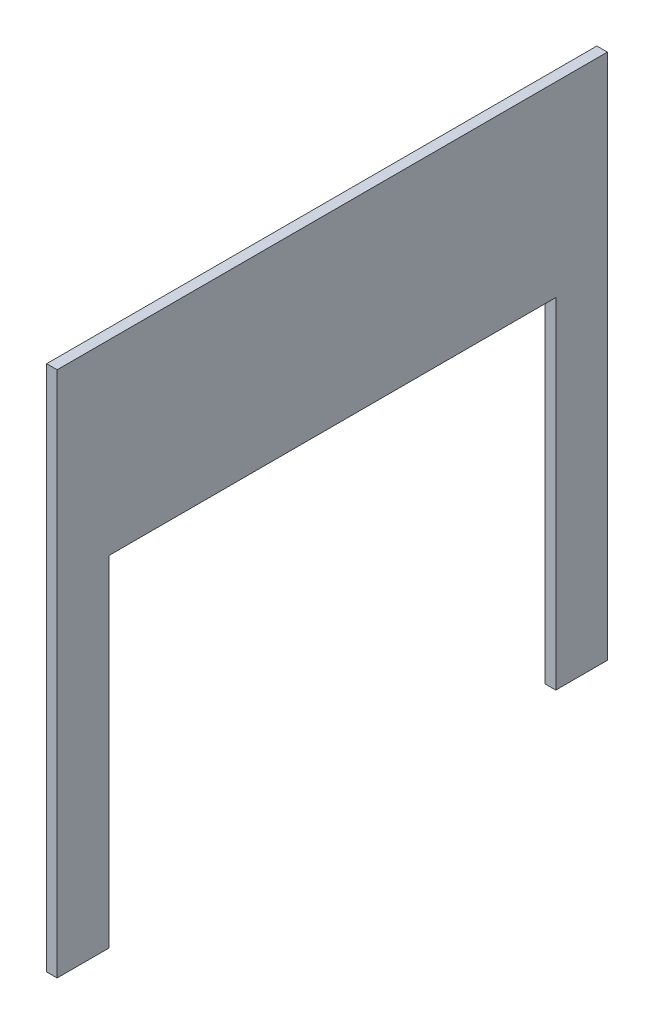
ISO-10303-21;
HEADER;
FILE_DESCRIPTION(('STEP AP214'),'2;1');
FILE_NAME('part.step','',(''),(''),'','','');
FILE_SCHEMA(('AUTOMOTIVE_DESIGN { 1 0 10303 214 1 1 1 1 }'));
ENDSEC;
DATA;
#1=APPLICATION_CONTEXT('core data for automotive mechanical design processes');
#2=APPLICATION_PROTOCOL_DEFINITION('international standard','automotive_design',2000,#1);
#3=PRODUCT_CONTEXT('',#1,'mechanical');
#4=PRODUCT('Part','Part','',(#3));
#5=PRODUCT_RELATED_PRODUCT_CATEGORY('part','',(#4));
#6=PRODUCT_DEFINITION_FORMATION('','',#4);
#7=PRODUCT_DEFINITION_CONTEXT('part definition',#1,'design');
#8=PRODUCT_DEFINITION('design','',#6,#7);
#9=PRODUCT_DEFINITION_SHAPE('','',#8);
#10=(LENGTH_UNIT() NAMED_UNIT(*) SI_UNIT(.MILLI.,.METRE.));
#11=(NAMED_UNIT(*) PLANE_ANGLE_UNIT() SI_UNIT($,.RADIAN.));
#12=(NAMED_UNIT(*) SI_UNIT($,.STERADIAN.) SOLID_ANGLE_UNIT());
#13=UNCERTAINTY_MEASURE_WITH_UNIT(LENGTH_MEASURE(1.E-05),#10,'distance_accuracy_value','');
#14=(GEOMETRIC_REPRESENTATION_CONTEXT(3) GLOBAL_UNCERTAINTY_ASSIGNED_CONTEXT((#13)) GLOBAL_UNIT_ASSIGNED_CONTEXT((#10,
#11,#12)) REPRESENTATION_CONTEXT('',''));
#15=CARTESIAN_POINT('',(0.,0.,0.));
#16=DIRECTION('',(0.,0.,1.));
#17=DIRECTION('',(1.,0.,0.));
#18=AXIS2_PLACEMENT_3D('',#15,#16,#17);
#19=CARTESIAN_POINT('',(10.,0.,0.));
#20=DIRECTION('',(0.,1.,0.));
#21=DIRECTION('',(0.,0.,1.));
#22=AXIS2_PLACEMENT_3D('',#19,#20,#21);
#23=PLANE('',#22);
#24=DIRECTION('',(0.,0.,-1.));
#25=VECTOR('',#24,1.);
#26=CARTESIAN_POINT('',(10.,0.,0.));
#27=LINE('',#26,#25);
#28=CARTESIAN_POINT('',(10.,0.,-473.3));
#29=VERTEX_POINT('',#28);
#30=CARTESIAN_POINT('',(10.,0.,-522.3));
#31=VERTEX_POINT('',#30);
#32=EDGE_CURVE('E123',#29,#31,#27,.T.);
#33=ORIENTED_EDGE('',*,*,#32,.F.);
#34=DIRECTION('',(-1.,0.,0.));
#35=VECTOR('',#34,1.);
#36=CARTESIAN_POINT('',(10.,0.,-473.3));
#37=LINE('',#36,#35);
#38=CARTESIAN_POINT('',(0.,0.,-473.3));
#39=VERTEX_POINT('',#38);
#40=EDGE_CURVE('E110',#29,#39,#37,.T.);
#41=ORIENTED_EDGE('',*,*,#40,.T.);
#42=DIRECTION('',(0.,0.,-1.));
#43=VECTOR('',#42,1.);
#44=CARTESIAN_POINT('',(0.,0.,0.));
#45=LINE('',#44,#43);
#46=CARTESIAN_POINT('',(0.,0.,-522.3));
#47=VERTEX_POINT('',#46);
#48=EDGE_CURVE('E143',#39,#47,#45,.T.);
#49=ORIENTED_EDGE('',*,*,#48,.T.);
#50=DIRECTION('',(-1.,0.,0.));
#51=VECTOR('',#50,1.);
#52=CARTESIAN_POINT('',(10.,0.,-522.3));
#53=LINE('',#52,#51);
#54=EDGE_CURVE('E43',#31,#47,#53,.T.);
#55=ORIENTED_EDGE('',*,*,#54,.F.);
#56=EDGE_LOOP('',(#33,#41,#49,#55));
#57=FACE_BOUND('',#56,.T.);
#58=ADVANCED_FACE('F35',(#57),#23,.F.);
#59=CARTESIAN_POINT('',(10.,0.,0.));
#60=DIRECTION('',(0.,0.,-1.));
#61=DIRECTION('',(0.,1.,0.));
#62=AXIS2_PLACEMENT_3D('',#59,#60,#61);
#63=PLANE('',#62);
#64=DIRECTION('',(0.,-1.,0.));
#65=VECTOR('',#64,1.);
#66=CARTESIAN_POINT('',(0.,0.,0.));
#67=LINE('',#66,#65);
#68=CARTESIAN_POINT('',(0.,500.,-1.11022302462516E-13));
#69=VERTEX_POINT('',#68);
#70=CARTESIAN_POINT('',(0.,0.,0.));
#71=VERTEX_POINT('',#70);
#72=EDGE_CURVE('E140',#69,#71,#67,.T.);
#73=ORIENTED_EDGE('',*,*,#72,.T.);
#74=DIRECTION('',(-1.,0.,0.));
#75=VECTOR('',#74,1.);
#76=CARTESIAN_POINT('',(10.,0.,0.));
#77=LINE('',#76,#75);
#78=CARTESIAN_POINT('',(10.,0.,0.));
#79=VERTEX_POINT('',#78);
#80=EDGE_CURVE('E11',#79,#71,#77,.T.);
#81=ORIENTED_EDGE('',*,*,#80,.F.);
#82=DIRECTION('',(0.,-1.,0.));
#83=VECTOR('',#82,1.);
#84=CARTESIAN_POINT('',(10.,0.,0.));
#85=LINE('',#84,#83);
#86=CARTESIAN_POINT('',(10.,500.,-1.11022302462516E-13));
#87=VERTEX_POINT('',#86);
#88=EDGE_CURVE('E132',#87,#79,#85,.T.);
#89=ORIENTED_EDGE('',*,*,#88,.F.);
#90=DIRECTION('',(-1.,0.,0.));
#91=VECTOR('',#90,1.);
#92=CARTESIAN_POINT('',(10.,500.,-1.11022302462516E-13));
#93=LINE('',#92,#91);
#94=EDGE_CURVE('E139',#87,#69,#93,.T.);
#95=ORIENTED_EDGE('',*,*,#94,.T.);
#96=EDGE_LOOP('',(#73,#81,#89,#95));
#97=FACE_BOUND('',#96,.T.);
#98=ADVANCED_FACE('F37',(#97),#63,.F.);
#99=CARTESIAN_POINT('',(0.,0.,-49.0000000000001));
#100=VERTEX_POINT('',#99);
#101=EDGE_CURVE('E145',#71,#100,#45,.T.);
#102=ORIENTED_EDGE('',*,*,#101,.T.);
#103=DIRECTION('',(-1.,0.,0.));
#104=VECTOR('',#103,1.);
#105=CARTESIAN_POINT('',(10.,0.,-49.0000000000001));
#106=LINE('',#105,#104);
#107=CARTESIAN_POINT('',(10.,0.,-49.0000000000001));
#108=VERTEX_POINT('',#107);
#109=EDGE_CURVE('E50',#108,#100,#106,.T.);
#110=ORIENTED_EDGE('',*,*,#109,.F.);
#111=EDGE_CURVE('E86',#79,#108,#27,.T.);
#112=ORIENTED_EDGE('',*,*,#111,.F.);
#113=ORIENTED_EDGE('',*,*,#80,.T.);
#114=EDGE_LOOP('',(#102,#110,#112,#113));
#115=FACE_BOUND('',#114,.T.);
#116=ADVANCED_FACE('F171',(#115),#23,.F.);
#117=CARTESIAN_POINT('',(10.,0.,-522.3));
#118=DIRECTION('',(0.,0.,1.));
#119=DIRECTION('',(1.,0.,0.));
#120=AXIS2_PLACEMENT_3D('',#117,#118,#119);
#121=PLANE('',#120);
#122=DIRECTION('',(0.,1.,0.));
#123=VECTOR('',#122,1.);
#124=CARTESIAN_POINT('',(0.,0.,-522.3));
#125=LINE('',#124,#123);
#126=CARTESIAN_POINT('',(0.,500.,-522.3));
#127=VERTEX_POINT('',#126);
#128=EDGE_CURVE('E148',#47,#127,#125,.T.);
#129=ORIENTED_EDGE('',*,*,#128,.T.);
#130=DIRECTION('',(-1.,0.,0.));
#131=VECTOR('',#130,1.);
#132=CARTESIAN_POINT('',(10.,500.,-522.3));
#133=LINE('',#132,#131);
#134=CARTESIAN_POINT('',(10.,500.,-522.3));
#135=VERTEX_POINT('',#134);
#136=EDGE_CURVE('E152',#135,#127,#133,.T.);
#137=ORIENTED_EDGE('',*,*,#136,.F.);
#138=DIRECTION('',(0.,1.,0.));
#139=VECTOR('',#138,1.);
#140=CARTESIAN_POINT('',(10.,0.,-522.3));
#141=LINE('',#140,#139);
#142=EDGE_CURVE('E134',#31,#135,#141,.T.);
#143=ORIENTED_EDGE('',*,*,#142,.F.);
#144=ORIENTED_EDGE('',*,*,#54,.T.);
#145=EDGE_LOOP('',(#129,#137,#143,#144));
#146=FACE_BOUND('',#145,.T.);
#147=ADVANCED_FACE('F155',(#146),#121,.F.);
#148=CARTESIAN_POINT('',(10.,500.,-1.11022302462516E-13));
#149=DIRECTION('',(0.,-1.,0.));
#150=DIRECTION('',(0.,0.,-1.));
#151=AXIS2_PLACEMENT_3D('',#148,#149,#150);
#152=PLANE('',#151);
#153=DIRECTION('',(0.,0.,1.));
#154=VECTOR('',#153,1.);
#155=CARTESIAN_POINT('',(0.,500.,-1.11022302462516E-13));
#156=LINE('',#155,#154);
#157=EDGE_CURVE('E80',#127,#69,#156,.T.);
#158=ORIENTED_EDGE('',*,*,#157,.T.);
#159=ORIENTED_EDGE('',*,*,#94,.F.);
#160=DIRECTION('',(0.,0.,1.));
#161=VECTOR('',#160,1.);
#162=CARTESIAN_POINT('',(10.,500.,-1.11022302462516E-13));
#163=LINE('',#162,#161);
#164=EDGE_CURVE('E59',#135,#87,#163,.T.);
#165=ORIENTED_EDGE('',*,*,#164,.F.);
#166=ORIENTED_EDGE('',*,*,#136,.T.);
#167=EDGE_LOOP('',(#158,#159,#165,#166));
#168=FACE_BOUND('',#167,.T.);
#169=ADVANCED_FACE('F163',(#168),#152,.F.);
#170=CARTESIAN_POINT('',(10.,0.,0.));
#171=DIRECTION('',(-1.,0.,0.));
#172=DIRECTION('',(0.,0.,1.));
#173=AXIS2_PLACEMENT_3D('',#170,#171,#172);
#174=PLANE('',#173);
#175=DIRECTION('',(0.,0.,-1.));
#176=VECTOR('',#175,1.);
#177=CARTESIAN_POINT('',(10.,322.7,-473.3));
#178=LINE('',#177,#176);
#179=CARTESIAN_POINT('',(10.,322.7,-49.0000000000001));
#180=VERTEX_POINT('',#179);
#181=CARTESIAN_POINT('',(10.,322.7,-473.3));
#182=VERTEX_POINT('',#181);
#183=EDGE_CURVE('E120',#180,#182,#178,.T.);
#184=ORIENTED_EDGE('',*,*,#183,.T.);
#185=DIRECTION('',(0.,-1.,0.));
#186=VECTOR('',#185,1.);
#187=CARTESIAN_POINT('',(10.,0.,-473.3));
#188=LINE('',#187,#186);
#189=EDGE_CURVE('E113',#182,#29,#188,.T.);
#190=ORIENTED_EDGE('',*,*,#189,.T.);
#191=ORIENTED_EDGE('',*,*,#32,.T.);
#192=ORIENTED_EDGE('',*,*,#142,.T.);
#193=ORIENTED_EDGE('',*,*,#164,.T.);
#194=ORIENTED_EDGE('',*,*,#88,.T.);
#195=ORIENTED_EDGE('',*,*,#111,.T.);
#196=DIRECTION('',(0.,1.,0.));
#197=VECTOR('',#196,1.);
#198=CARTESIAN_POINT('',(10.,0.,-49.0000000000001));
#199=LINE('',#198,#197);
#200=EDGE_CURVE('E127',#108,#180,#199,.T.);
#201=ORIENTED_EDGE('',*,*,#200,.T.);
#202=EDGE_LOOP('',(#184,#190,#191,#192,#193,#194,#195,#201));
#203=FACE_BOUND('',#202,.T.);
#204=ADVANCED_FACE('F122',(#203),#174,.F.);
#205=CARTESIAN_POINT('',(0.,0.,0.));
#206=DIRECTION('',(-1.,0.,0.));
#207=DIRECTION('',(0.,0.,1.));
#208=AXIS2_PLACEMENT_3D('',#205,#206,#207);
#209=PLANE('',#208);
#210=DIRECTION('',(0.,-1.,0.));
#211=VECTOR('',#210,1.);
#212=CARTESIAN_POINT('',(0.,0.,-473.3));
#213=LINE('',#212,#211);
#214=CARTESIAN_POINT('',(0.,322.7,-473.3));
#215=VERTEX_POINT('',#214);
#216=EDGE_CURVE('E116',#215,#39,#213,.T.);
#217=ORIENTED_EDGE('',*,*,#216,.F.);
#218=DIRECTION('',(0.,0.,-1.));
#219=VECTOR('',#218,1.);
#220=CARTESIAN_POINT('',(0.,322.7,-473.3));
#221=LINE('',#220,#219);
#222=CARTESIAN_POINT('',(0.,322.7,-49.0000000000001));
#223=VERTEX_POINT('',#222);
#224=EDGE_CURVE('E128',#223,#215,#221,.T.);
#225=ORIENTED_EDGE('',*,*,#224,.F.);
#226=DIRECTION('',(0.,1.,0.));
#227=VECTOR('',#226,1.);
#228=CARTESIAN_POINT('',(0.,0.,-49.0000000000001));
#229=LINE('',#228,#227);
#230=EDGE_CURVE('E187',#100,#223,#229,.T.);
#231=ORIENTED_EDGE('',*,*,#230,.F.);
#232=ORIENTED_EDGE('',*,*,#101,.F.);
#233=ORIENTED_EDGE('',*,*,#72,.F.);
#234=ORIENTED_EDGE('',*,*,#157,.F.);
#235=ORIENTED_EDGE('',*,*,#128,.F.);
#236=ORIENTED_EDGE('',*,*,#48,.F.);
#237=EDGE_LOOP('',(#217,#225,#231,#232,#233,#234,#235,#236));
#238=FACE_BOUND('',#237,.T.);
#239=ADVANCED_FACE('F158',(#238),#209,.T.);
#240=CARTESIAN_POINT('',(10.,0.,-473.3));
#241=DIRECTION('',(0.,0.,-1.));
#242=DIRECTION('',(0.,1.,0.));
#243=AXIS2_PLACEMENT_3D('',#240,#241,#242);
#244=PLANE('',#243);
#245=ORIENTED_EDGE('',*,*,#216,.T.);
#246=ORIENTED_EDGE('',*,*,#40,.F.);
#247=ORIENTED_EDGE('',*,*,#189,.F.);
#248=DIRECTION('',(-1.,0.,0.));
#249=VECTOR('',#248,1.);
#250=CARTESIAN_POINT('',(10.,322.7,-473.3));
#251=LINE('',#250,#249);
#252=EDGE_CURVE('E144',#182,#215,#251,.T.);
#253=ORIENTED_EDGE('',*,*,#252,.T.);
#254=EDGE_LOOP('',(#245,#246,#247,#253));
#255=FACE_BOUND('',#254,.T.);
#256=ADVANCED_FACE('F112',(#255),#244,.F.);
#257=CARTESIAN_POINT('',(10.,322.7,-473.3));
#258=DIRECTION('',(0.,1.,0.));
#259=DIRECTION('',(0.,0.,1.));
#260=AXIS2_PLACEMENT_3D('',#257,#258,#259);
#261=PLANE('',#260);
#262=ORIENTED_EDGE('',*,*,#224,.T.);
#263=ORIENTED_EDGE('',*,*,#252,.F.);
#264=ORIENTED_EDGE('',*,*,#183,.F.);
#265=DIRECTION('',(-1.,0.,0.));
#266=VECTOR('',#265,1.);
#267=CARTESIAN_POINT('',(10.,322.7,-49.0000000000001));
#268=LINE('',#267,#266);
#269=EDGE_CURVE('E181',#180,#223,#268,.T.);
#270=ORIENTED_EDGE('',*,*,#269,.T.);
#271=EDGE_LOOP('',(#262,#263,#264,#270));
#272=FACE_BOUND('',#271,.T.);
#273=ADVANCED_FACE('F193',(#272),#261,.F.);
#274=CARTESIAN_POINT('',(10.,0.,-49.0000000000001));
#275=DIRECTION('',(0.,0.,1.));
#276=DIRECTION('',(0.,-1.,0.));
#277=AXIS2_PLACEMENT_3D('',#274,#275,#276);
#278=PLANE('',#277);
#279=ORIENTED_EDGE('',*,*,#230,.T.);
#280=ORIENTED_EDGE('',*,*,#269,.F.);
#281=ORIENTED_EDGE('',*,*,#200,.F.);
#282=ORIENTED_EDGE('',*,*,#109,.T.);
#283=EDGE_LOOP('',(#279,#280,#281,#282));
#284=FACE_BOUND('',#283,.T.);
#285=ADVANCED_FACE('F195',(#284),#278,.F.);
#286=CLOSED_SHELL('',(#58,#98,#116,#147,#169,#204,#239,#256,#273,#285));
#287=MANIFOLD_SOLID_BREP('B2',#286);
#288=ADVANCED_BREP_SHAPE_REPRESENTATION('',(#18,#287),#14);
#289=SHAPE_DEFINITION_REPRESENTATION(#9,#288);
ENDSEC;
END-ISO-10303-21;
